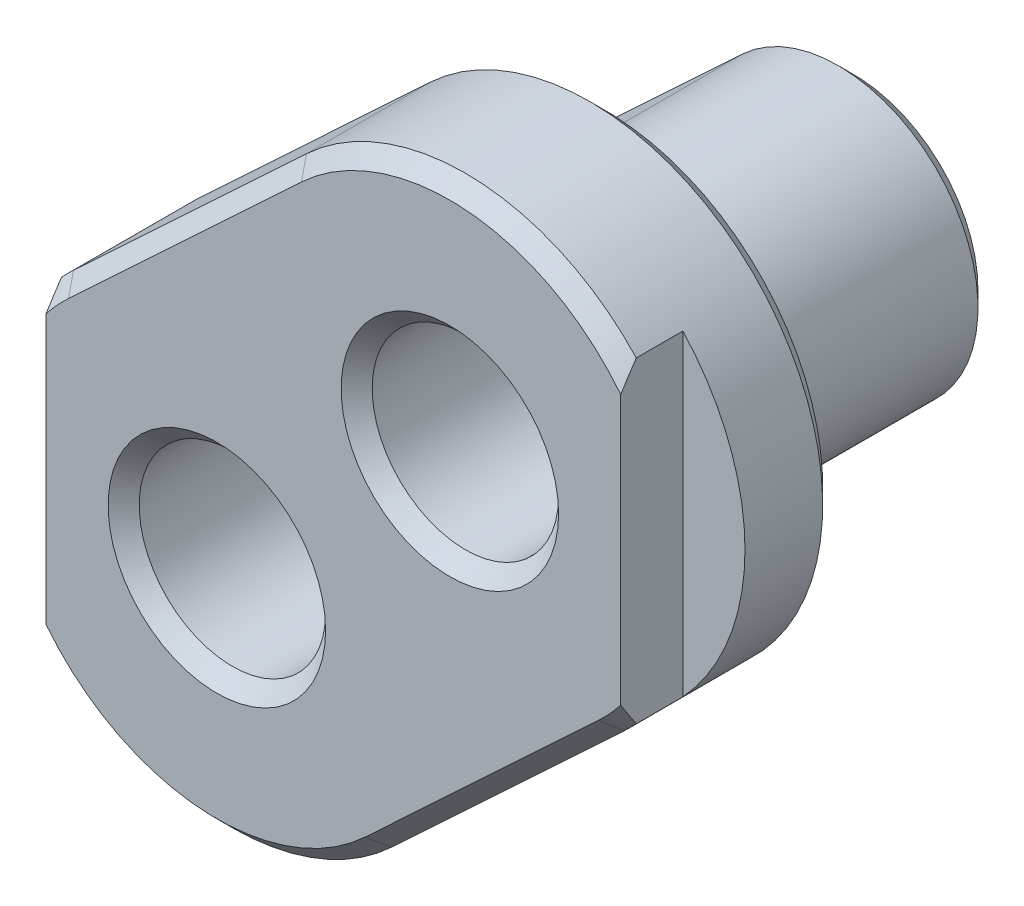
ISO-10303-21;
HEADER;
FILE_DESCRIPTION(('STEP AP214'),'2;1');
FILE_NAME('part.step','',(''),(''),'','','');
FILE_SCHEMA(('AUTOMOTIVE_DESIGN { 1 0 10303 214 1 1 1 1 }'));
ENDSEC;
DATA;
#1=APPLICATION_CONTEXT('core data for automotive mechanical design processes');
#2=APPLICATION_PROTOCOL_DEFINITION('international standard','automotive_design',2000,#1);
#3=PRODUCT_CONTEXT('',#1,'mechanical');
#4=PRODUCT('Part','Part','',(#3));
#5=PRODUCT_RELATED_PRODUCT_CATEGORY('part','',(#4));
#6=PRODUCT_DEFINITION_FORMATION('','',#4);
#7=PRODUCT_DEFINITION_CONTEXT('part definition',#1,'design');
#8=PRODUCT_DEFINITION('design','',#6,#7);
#9=PRODUCT_DEFINITION_SHAPE('','',#8);
#10=(LENGTH_UNIT() NAMED_UNIT(*) SI_UNIT(.MILLI.,.METRE.));
#11=(NAMED_UNIT(*) PLANE_ANGLE_UNIT() SI_UNIT($,.RADIAN.));
#12=(NAMED_UNIT(*) SI_UNIT($,.STERADIAN.) SOLID_ANGLE_UNIT());
#13=UNCERTAINTY_MEASURE_WITH_UNIT(LENGTH_MEASURE(1.E-05),#10,'distance_accuracy_value','');
#14=(GEOMETRIC_REPRESENTATION_CONTEXT(3) GLOBAL_UNCERTAINTY_ASSIGNED_CONTEXT((#13)) GLOBAL_UNIT_ASSIGNED_CONTEXT((#10,
#11,#12)) REPRESENTATION_CONTEXT('',''));
#15=CARTESIAN_POINT('',(0.,0.,0.));
#16=DIRECTION('',(0.,0.,1.));
#17=DIRECTION('',(1.,0.,0.));
#18=AXIS2_PLACEMENT_3D('',#15,#16,#17);
#19=CARTESIAN_POINT('',(0.,0.,16.));
#20=DIRECTION('',(0.,0.,-1.));
#21=DIRECTION('',(-1.,0.,0.));
#22=AXIS2_PLACEMENT_3D('',#19,#20,#21);
#23=CYLINDRICAL_SURFACE('',#22,9.00000000000002);
#24=DIRECTION('',(0.,0.,-1.));
#25=VECTOR('',#24,1.);
#26=CARTESIAN_POINT('',(-6.1408642532401,6.57949741418584,16.));
#27=LINE('',#26,#25);
#28=CARTESIAN_POINT('',(-6.1408642532401,6.57949741418584,16.));
#29=VERTEX_POINT('',#28);
#30=CARTESIAN_POINT('',(-6.1408642532401,6.57949741418584,1.));
#31=VERTEX_POINT('',#30);
#32=EDGE_CURVE('E238',#29,#31,#27,.T.);
#33=ORIENTED_EDGE('',*,*,#32,.T.);
#34=CARTESIAN_POINT('',(0.,0.,1.));
#35=DIRECTION('',(0.,0.,1.));
#36=DIRECTION('',(1.,0.,0.));
#37=AXIS2_PLACEMENT_3D('',#34,#35,#36);
#38=CIRCLE('',#37,9.00000000000002);
#39=CARTESIAN_POINT('',(6.14086425324012,-6.57949741418583,1.));
#40=VERTEX_POINT('',#39);
#41=EDGE_CURVE('E272',#31,#40,#38,.T.);
#42=ORIENTED_EDGE('',*,*,#41,.T.);
#43=DIRECTION('',(0.,0.,-1.));
#44=VECTOR('',#43,1.);
#45=CARTESIAN_POINT('',(6.14086425324012,-6.57949741418583,16.));
#46=LINE('',#45,#44);
#47=CARTESIAN_POINT('',(6.14086425324012,-6.57949741418583,16.));
#48=VERTEX_POINT('',#47);
#49=EDGE_CURVE('E247',#48,#40,#46,.T.);
#50=ORIENTED_EDGE('',*,*,#49,.F.);
#51=CARTESIAN_POINT('',(0.,0.,16.));
#52=DIRECTION('',(0.,0.,1.));
#53=DIRECTION('',(1.,0.,0.));
#54=AXIS2_PLACEMENT_3D('',#51,#52,#53);
#55=CIRCLE('',#54,9.00000000000002);
#56=EDGE_CURVE('E226',#29,#48,#55,.T.);
#57=ORIENTED_EDGE('',*,*,#56,.F.);
#58=EDGE_LOOP('',(#33,#42,#50,#57));
#59=FACE_BOUND('',#58,.T.);
#60=ADVANCED_FACE('F34',(#59),#23,.T.);
#61=CARTESIAN_POINT('',(6.14086425324012,-6.57949741418583,16.));
#62=DIRECTION('',(-0.682318250360011,0.731055268242869,0.));
#63=DIRECTION('',(-0.731055268242869,-0.682318250360011,0.));
#64=AXIS2_PLACEMENT_3D('',#61,#62,#63);
#65=PLANE('',#64);
#66=ORIENTED_EDGE('',*,*,#49,.T.);
#67=DIRECTION('',(0.731055268242869,0.682318250360011,0.));
#68=VECTOR('',#67,1.);
#69=CARTESIAN_POINT('',(6.14086425324012,-6.57949741418583,1.));
#70=LINE('',#69,#68);
#71=CARTESIAN_POINT('',(21.1408642532401,7.42050258581419,1.));
#72=VERTEX_POINT('',#71);
#73=EDGE_CURVE('E250',#40,#72,#70,.T.);
#74=ORIENTED_EDGE('',*,*,#73,.T.);
#75=DIRECTION('',(0.,0.,-1.));
#76=VECTOR('',#75,1.);
#77=CARTESIAN_POINT('',(21.1408642532401,7.42050258581419,16.));
#78=LINE('',#77,#76);
#79=CARTESIAN_POINT('',(21.1408642532401,7.42050258581419,16.));
#80=VERTEX_POINT('',#79);
#81=EDGE_CURVE('E244',#80,#72,#78,.T.);
#82=ORIENTED_EDGE('',*,*,#81,.F.);
#83=DIRECTION('',(0.731055268242869,0.682318250360011,0.));
#84=VECTOR('',#83,1.);
#85=CARTESIAN_POINT('',(6.14086425324012,-6.57949741418583,16.));
#86=LINE('',#85,#84);
#87=EDGE_CURVE('E229',#48,#80,#86,.T.);
#88=ORIENTED_EDGE('',*,*,#87,.F.);
#89=EDGE_LOOP('',(#66,#74,#82,#88));
#90=FACE_BOUND('',#89,.T.);
#91=ADVANCED_FACE('F398',(#90),#65,.F.);
#92=CARTESIAN_POINT('',(15.,14.,16.));
#93=DIRECTION('',(0.,0.,-1.));
#94=DIRECTION('',(-1.,0.,0.));
#95=AXIS2_PLACEMENT_3D('',#92,#93,#94);
#96=CYLINDRICAL_SURFACE('',#95,9.);
#97=ORIENTED_EDGE('',*,*,#81,.T.);
#98=CARTESIAN_POINT('',(15.,14.,1.));
#99=DIRECTION('',(0.,0.,1.));
#100=DIRECTION('',(1.,0.,0.));
#101=AXIS2_PLACEMENT_3D('',#98,#99,#100);
#102=CIRCLE('',#101,9.);
#103=CARTESIAN_POINT('',(8.85913574675993,20.5794974141858,0.999999999999999));
#104=VERTEX_POINT('',#103);
#105=EDGE_CURVE('E268',#72,#104,#102,.T.);
#106=ORIENTED_EDGE('',*,*,#105,.T.);
#107=DIRECTION('',(0.,0.,-1.));
#108=VECTOR('',#107,1.);
#109=CARTESIAN_POINT('',(8.85913574675993,20.5794974141858,16.));
#110=LINE('',#109,#108);
#111=CARTESIAN_POINT('',(8.85913574675993,20.5794974141858,16.));
#112=VERTEX_POINT('',#111);
#113=EDGE_CURVE('E241',#112,#104,#110,.T.);
#114=ORIENTED_EDGE('',*,*,#113,.F.);
#115=CARTESIAN_POINT('',(15.,14.,16.));
#116=DIRECTION('',(0.,0.,1.));
#117=DIRECTION('',(1.,0.,0.));
#118=AXIS2_PLACEMENT_3D('',#115,#116,#117);
#119=CIRCLE('',#118,9.);
#120=EDGE_CURVE('E232',#80,#112,#119,.T.);
#121=ORIENTED_EDGE('',*,*,#120,.F.);
#122=EDGE_LOOP('',(#97,#106,#114,#121));
#123=FACE_BOUND('',#122,.T.);
#124=ADVANCED_FACE('F404',(#123),#96,.T.);
#125=CARTESIAN_POINT('',(8.85913574675992,20.5794974141858,16.));
#126=DIRECTION('',(0.68231825036001,-0.73105526824287,0.));
#127=DIRECTION('',(0.73105526824287,0.68231825036001,0.));
#128=AXIS2_PLACEMENT_3D('',#125,#126,#127);
#129=PLANE('',#128);
#130=ORIENTED_EDGE('',*,*,#113,.T.);
#131=DIRECTION('',(-0.73105526824287,-0.68231825036001,0.));
#132=VECTOR('',#131,1.);
#133=CARTESIAN_POINT('',(8.85913574675992,20.5794974141858,0.999999999999999));
#134=LINE('',#133,#132);
#135=EDGE_CURVE('E270',#104,#31,#134,.T.);
#136=ORIENTED_EDGE('',*,*,#135,.T.);
#137=ORIENTED_EDGE('',*,*,#32,.F.);
#138=DIRECTION('',(-0.73105526824287,-0.68231825036001,0.));
#139=VECTOR('',#138,1.);
#140=CARTESIAN_POINT('',(8.85913574675992,20.5794974141858,16.));
#141=LINE('',#140,#139);
#142=EDGE_CURVE('E235',#112,#29,#141,.T.);
#143=ORIENTED_EDGE('',*,*,#142,.F.);
#144=EDGE_LOOP('',(#130,#136,#137,#143));
#145=FACE_BOUND('',#144,.T.);
#146=ADVANCED_FACE('F545',(#145),#129,.F.);
#147=CARTESIAN_POINT('',(0.,0.,0.));
#148=DIRECTION('',(0.,0.,1.));
#149=DIRECTION('',(1.,0.,0.));
#150=AXIS2_PLACEMENT_3D('',#147,#148,#149);
#151=PLANE('',#150);
#152=CARTESIAN_POINT('',(15.,14.,0.));
#153=DIRECTION('',(0.,0.,1.));
#154=DIRECTION('',(1.,0.,0.));
#155=AXIS2_PLACEMENT_3D('',#152,#153,#154);
#156=CIRCLE('',#155,7.99999999999999);
#157=CARTESIAN_POINT('',(9.54145399711995,19.848442145943,0.));
#158=VERTEX_POINT('',#157);
#159=CARTESIAN_POINT('',(20.4585460028801,8.15155785405706,0.));
#160=VERTEX_POINT('',#159);
#161=EDGE_CURVE('E263',#158,#160,#156,.F.);
#162=ORIENTED_EDGE('',*,*,#161,.T.);
#163=DIRECTION('',(-0.731055268242869,-0.682318250360011,0.));
#164=VECTOR('',#163,1.);
#165=CARTESIAN_POINT('',(5.4585460028801,-5.84844214594296,0.));
#166=LINE('',#165,#164);
#167=CARTESIAN_POINT('',(5.4585460028801,-5.84844214594295,0.));
#168=VERTEX_POINT('',#167);
#169=EDGE_CURVE('E265',#160,#168,#166,.T.);
#170=ORIENTED_EDGE('',*,*,#169,.T.);
#171=CARTESIAN_POINT('',(0.,0.,0.));
#172=DIRECTION('',(0.,0.,1.));
#173=DIRECTION('',(1.,0.,0.));
#174=AXIS2_PLACEMENT_3D('',#171,#172,#173);
#175=CIRCLE('',#174,8.00000000000001);
#176=CARTESIAN_POINT('',(-5.45854600288009,5.84844214594296,0.));
#177=VERTEX_POINT('',#176);
#178=EDGE_CURVE('E259',#168,#177,#175,.F.);
#179=ORIENTED_EDGE('',*,*,#178,.T.);
#180=DIRECTION('',(0.73105526824287,0.68231825036001,0.));
#181=VECTOR('',#180,1.);
#182=CARTESIAN_POINT('',(-5.45854600288009,5.84844214594297,0.));
#183=LINE('',#182,#181);
#184=EDGE_CURVE('E261',#177,#158,#183,.T.);
#185=ORIENTED_EDGE('',*,*,#184,.T.);
#186=EDGE_LOOP('',(#162,#170,#179,#185));
#187=FACE_BOUND('',#186,.T.);
#188=CARTESIAN_POINT('',(15.,14.,0.));
#189=DIRECTION('',(0.,0.,1.));
#190=DIRECTION('',(1.,0.,0.));
#191=AXIS2_PLACEMENT_3D('',#188,#189,#190);
#192=CIRCLE('',#191,7.00000000000003);
#193=CARTESIAN_POINT('',(22.,14.,0.));
#194=VERTEX_POINT('',#193);
#195=EDGE_CURVE('E256',#194,#194,#192,.T.);
#196=ORIENTED_EDGE('',*,*,#195,.T.);
#197=EDGE_LOOP('',(#196));
#198=FACE_BOUND('',#197,.T.);
#199=CARTESIAN_POINT('',(0.,0.,0.));
#200=DIRECTION('',(0.,0.,1.));
#201=DIRECTION('',(1.,0.,0.));
#202=AXIS2_PLACEMENT_3D('',#199,#200,#201);
#203=CIRCLE('',#202,7.00000000000001);
#204=CARTESIAN_POINT('',(7.00000000000001,0.,0.));
#205=VERTEX_POINT('',#204);
#206=EDGE_CURVE('E253',#205,#205,#203,.T.);
#207=ORIENTED_EDGE('',*,*,#206,.T.);
#208=EDGE_LOOP('',(#207));
#209=FACE_BOUND('',#208,.T.);
#210=ADVANCED_FACE('F535',(#187,#198,#209),#151,.F.);
#211=CARTESIAN_POINT('',(0.,0.,16.));
#212=DIRECTION('',(0.,0.,1.));
#213=DIRECTION('',(1.,0.,0.));
#214=AXIS2_PLACEMENT_3D('',#211,#212,#213);
#215=PLANE('',#214);
#216=CARTESIAN_POINT('',(0.,0.,16.));
#217=DIRECTION('',(0.,0.,1.));
#218=DIRECTION('',(1.,0.,0.));
#219=AXIS2_PLACEMENT_3D('',#216,#217,#218);
#220=CIRCLE('',#219,14.);
#221=CARTESIAN_POINT('',(9.55245550504017,-10.2347737554002,16.));
#222=VERTEX_POINT('',#221);
#223=CARTESIAN_POINT('',(-9.55245550504015,10.2347737554002,16.));
#224=VERTEX_POINT('',#223);
#225=EDGE_CURVE('E295',#222,#224,#220,.F.);
#226=ORIENTED_EDGE('',*,*,#225,.T.);
#227=DIRECTION('',(0.73105526824287,0.68231825036001,0.));
#228=VECTOR('',#227,1.);
#229=CARTESIAN_POINT('',(-9.55245550504015,10.2347737554002,16.));
#230=LINE('',#229,#228);
#231=CARTESIAN_POINT('',(5.44754449495988,24.2347737554002,16.));
#232=VERTEX_POINT('',#231);
#233=EDGE_CURVE('E297',#224,#232,#230,.T.);
#234=ORIENTED_EDGE('',*,*,#233,.T.);
#235=CARTESIAN_POINT('',(15.,14.,16.));
#236=DIRECTION('',(0.,0.,1.));
#237=DIRECTION('',(1.,0.,0.));
#238=AXIS2_PLACEMENT_3D('',#235,#236,#237);
#239=CIRCLE('',#238,14.);
#240=CARTESIAN_POINT('',(24.5524555050402,3.76522624459985,16.));
#241=VERTEX_POINT('',#240);
#242=EDGE_CURVE('E293',#232,#241,#239,.F.);
#243=ORIENTED_EDGE('',*,*,#242,.T.);
#244=DIRECTION('',(-0.731055268242869,-0.682318250360011,0.));
#245=VECTOR('',#244,1.);
#246=CARTESIAN_POINT('',(9.55245550504017,-10.2347737554002,16.));
#247=LINE('',#246,#245);
#248=EDGE_CURVE('E291',#241,#222,#247,.T.);
#249=ORIENTED_EDGE('',*,*,#248,.T.);
#250=EDGE_LOOP('',(#226,#234,#243,#249));
#251=FACE_BOUND('',#250,.T.);
#252=ORIENTED_EDGE('',*,*,#142,.T.);
#253=ORIENTED_EDGE('',*,*,#56,.T.);
#254=ORIENTED_EDGE('',*,*,#87,.T.);
#255=ORIENTED_EDGE('',*,*,#120,.T.);
#256=EDGE_LOOP('',(#252,#253,#254,#255));
#257=FACE_BOUND('',#256,.T.);
#258=ADVANCED_FACE('F542',(#251,#257),#215,.F.);
#259=CARTESIAN_POINT('',(0.,0.,26.));
#260=DIRECTION('',(0.,0.,-1.));
#261=DIRECTION('',(-1.,0.,0.));
#262=AXIS2_PLACEMENT_3D('',#259,#260,#261);
#263=CYLINDRICAL_SURFACE('',#262,15.);
#264=DIRECTION('',(0.,0.,-1.));
#265=VECTOR('',#264,1.);
#266=CARTESIAN_POINT('',(-10.2347737554002,10.9658290236431,26.));
#267=LINE('',#266,#265);
#268=CARTESIAN_POINT('',(-10.2347737554002,10.9658290236431,25.));
#269=VERTEX_POINT('',#268);
#270=CARTESIAN_POINT('',(-10.2347737554002,10.9658290236431,17.));
#271=VERTEX_POINT('',#270);
#272=EDGE_CURVE('E197',#269,#271,#267,.T.);
#273=ORIENTED_EDGE('',*,*,#272,.T.);
#274=CARTESIAN_POINT('',(0.,0.,17.));
#275=DIRECTION('',(0.,0.,1.));
#276=DIRECTION('',(1.,0.,0.));
#277=AXIS2_PLACEMENT_3D('',#274,#275,#276);
#278=CIRCLE('',#277,15.);
#279=CARTESIAN_POINT('',(10.2347737554002,-10.965829023643,17.));
#280=VERTEX_POINT('',#279);
#281=EDGE_CURVE('E304',#271,#280,#278,.T.);
#282=ORIENTED_EDGE('',*,*,#281,.T.);
#283=DIRECTION('',(0.,0.,-1.));
#284=VECTOR('',#283,1.);
#285=CARTESIAN_POINT('',(10.2347737554002,-10.965829023643,26.));
#286=LINE('',#285,#284);
#287=CARTESIAN_POINT('',(10.2347737554002,-10.965829023643,25.));
#288=VERTEX_POINT('',#287);
#289=EDGE_CURVE('E223',#288,#280,#286,.T.);
#290=ORIENTED_EDGE('',*,*,#289,.F.);
#291=CARTESIAN_POINT('',(0.,0.,25.));
#292=DIRECTION('',(0.,0.,1.));
#293=DIRECTION('',(1.,0.,0.));
#294=AXIS2_PLACEMENT_3D('',#291,#292,#293);
#295=CIRCLE('',#294,15.);
#296=CARTESIAN_POINT('',(-11.,-10.1980390271856,25.));
#297=VERTEX_POINT('',#296);
#298=EDGE_CURVE('E302',#288,#297,#295,.F.);
#299=ORIENTED_EDGE('',*,*,#298,.T.);
#300=DIRECTION('',(0.,0.,1.));
#301=VECTOR('',#300,1.);
#302=CARTESIAN_POINT('',(-11.,-10.1980390271856,22.));
#303=LINE('',#302,#301);
#304=CARTESIAN_POINT('',(-11.,-10.1980390271856,22.));
#305=VERTEX_POINT('',#304);
#306=EDGE_CURVE('E207',#305,#297,#303,.T.);
#307=ORIENTED_EDGE('',*,*,#306,.F.);
#308=CARTESIAN_POINT('',(0.,0.,22.));
#309=DIRECTION('',(0.,0.,1.));
#310=DIRECTION('',(1.,0.,0.));
#311=AXIS2_PLACEMENT_3D('',#308,#309,#310);
#312=CIRCLE('',#311,15.);
#313=CARTESIAN_POINT('',(-11.,10.1980390271856,22.));
#314=VERTEX_POINT('',#313);
#315=EDGE_CURVE('E201',#314,#305,#312,.T.);
#316=ORIENTED_EDGE('',*,*,#315,.F.);
#317=DIRECTION('',(0.,0.,1.));
#318=VECTOR('',#317,1.);
#319=CARTESIAN_POINT('',(-11.,10.1980390271856,22.));
#320=LINE('',#319,#318);
#321=CARTESIAN_POINT('',(-11.,10.1980390271856,25.));
#322=VERTEX_POINT('',#321);
#323=EDGE_CURVE('E211',#314,#322,#320,.T.);
#324=ORIENTED_EDGE('',*,*,#323,.T.);
#325=CARTESIAN_POINT('',(0.,0.,25.));
#326=DIRECTION('',(0.,0.,1.));
#327=DIRECTION('',(1.,0.,0.));
#328=AXIS2_PLACEMENT_3D('',#325,#326,#327);
#329=CIRCLE('',#328,15.);
#330=EDGE_CURVE('E300',#322,#269,#329,.F.);
#331=ORIENTED_EDGE('',*,*,#330,.T.);
#332=EDGE_LOOP('',(#273,#282,#290,#299,#307,#316,#324,#331));
#333=FACE_BOUND('',#332,.T.);
#334=ADVANCED_FACE('F501',(#333),#263,.T.);
#335=CARTESIAN_POINT('',(10.2347737554002,-10.965829023643,26.));
#336=DIRECTION('',(-0.682318250360011,0.731055268242869,0.));
#337=DIRECTION('',(-0.731055268242869,-0.682318250360011,0.));
#338=AXIS2_PLACEMENT_3D('',#335,#336,#337);
#339=PLANE('',#338);
#340=ORIENTED_EDGE('',*,*,#289,.T.);
#341=DIRECTION('',(0.731055268242869,0.682318250360011,0.));
#342=VECTOR('',#341,1.);
#343=CARTESIAN_POINT('',(10.2347737554002,-10.965829023643,17.));
#344=LINE('',#343,#342);
#345=CARTESIAN_POINT('',(25.2347737554002,3.03417097635697,17.));
#346=VERTEX_POINT('',#345);
#347=EDGE_CURVE('E313',#280,#346,#344,.T.);
#348=ORIENTED_EDGE('',*,*,#347,.T.);
#349=DIRECTION('',(0.,0.,-1.));
#350=VECTOR('',#349,1.);
#351=CARTESIAN_POINT('',(25.2347737554002,3.03417097635697,26.));
#352=LINE('',#351,#350);
#353=CARTESIAN_POINT('',(25.2347737554002,3.03417097635697,25.));
#354=VERTEX_POINT('',#353);
#355=EDGE_CURVE('E221',#354,#346,#352,.T.);
#356=ORIENTED_EDGE('',*,*,#355,.F.);
#357=DIRECTION('',(-0.731055268242869,-0.682318250360011,0.));
#358=VECTOR('',#357,1.);
#359=CARTESIAN_POINT('',(10.2347737554002,-10.965829023643,25.));
#360=LINE('',#359,#358);
#361=EDGE_CURVE('E311',#354,#288,#360,.T.);
#362=ORIENTED_EDGE('',*,*,#361,.T.);
#363=EDGE_LOOP('',(#340,#348,#356,#362));
#364=FACE_BOUND('',#363,.T.);
#365=ADVANCED_FACE('F498',(#364),#339,.F.);
#366=CARTESIAN_POINT('',(15.,14.,26.));
#367=DIRECTION('',(0.,0.,-1.));
#368=DIRECTION('',(-1.,0.,0.));
#369=AXIS2_PLACEMENT_3D('',#366,#367,#368);
#370=CYLINDRICAL_SURFACE('',#369,15.);
#371=ORIENTED_EDGE('',*,*,#355,.T.);
#372=CARTESIAN_POINT('',(15.,14.,17.));
#373=DIRECTION('',(0.,0.,1.));
#374=DIRECTION('',(1.,0.,0.));
#375=AXIS2_PLACEMENT_3D('',#372,#373,#374);
#376=CIRCLE('',#375,15.);
#377=CARTESIAN_POINT('',(4.76522624459987,24.9658290236431,17.));
#378=VERTEX_POINT('',#377);
#379=EDGE_CURVE('E309',#346,#378,#376,.T.);
#380=ORIENTED_EDGE('',*,*,#379,.T.);
#381=DIRECTION('',(0.,0.,-1.));
#382=VECTOR('',#381,1.);
#383=CARTESIAN_POINT('',(4.76522624459987,24.9658290236431,26.));
#384=LINE('',#383,#382);
#385=CARTESIAN_POINT('',(4.76522624459987,24.9658290236431,25.));
#386=VERTEX_POINT('',#385);
#387=EDGE_CURVE('E218',#386,#378,#384,.T.);
#388=ORIENTED_EDGE('',*,*,#387,.F.);
#389=CARTESIAN_POINT('',(15.,14.,25.));
#390=DIRECTION('',(0.,0.,1.));
#391=DIRECTION('',(1.,0.,0.));
#392=AXIS2_PLACEMENT_3D('',#389,#390,#391);
#393=CIRCLE('',#392,15.);
#394=CARTESIAN_POINT('',(26.,24.1980390271856,25.));
#395=VERTEX_POINT('',#394);
#396=EDGE_CURVE('E195',#386,#395,#393,.F.);
#397=ORIENTED_EDGE('',*,*,#396,.T.);
#398=DIRECTION('',(0.,0.,1.));
#399=VECTOR('',#398,1.);
#400=CARTESIAN_POINT('',(26.,24.1980390271856,22.));
#401=LINE('',#400,#399);
#402=CARTESIAN_POINT('',(26.,24.1980390271856,22.));
#403=VERTEX_POINT('',#402);
#404=EDGE_CURVE('E187',#403,#395,#401,.T.);
#405=ORIENTED_EDGE('',*,*,#404,.F.);
#406=CARTESIAN_POINT('',(15.,14.,22.));
#407=DIRECTION('',(0.,0.,1.));
#408=DIRECTION('',(1.,0.,0.));
#409=AXIS2_PLACEMENT_3D('',#406,#407,#408);
#410=CIRCLE('',#409,15.);
#411=CARTESIAN_POINT('',(26.,3.80196097281442,22.));
#412=VERTEX_POINT('',#411);
#413=EDGE_CURVE('E174',#412,#403,#410,.T.);
#414=ORIENTED_EDGE('',*,*,#413,.F.);
#415=DIRECTION('',(0.,0.,1.));
#416=VECTOR('',#415,1.);
#417=CARTESIAN_POINT('',(26.,3.80196097281442,22.));
#418=LINE('',#417,#416);
#419=CARTESIAN_POINT('',(26.,3.80196097281442,25.));
#420=VERTEX_POINT('',#419);
#421=EDGE_CURVE('E189',#412,#420,#418,.T.);
#422=ORIENTED_EDGE('',*,*,#421,.T.);
#423=CARTESIAN_POINT('',(15.,14.,25.));
#424=DIRECTION('',(0.,0.,1.));
#425=DIRECTION('',(1.,0.,0.));
#426=AXIS2_PLACEMENT_3D('',#423,#424,#425);
#427=CIRCLE('',#426,15.);
#428=EDGE_CURVE('E307',#420,#354,#427,.F.);
#429=ORIENTED_EDGE('',*,*,#428,.T.);
#430=EDGE_LOOP('',(#371,#380,#388,#397,#405,#414,#422,#429));
#431=FACE_BOUND('',#430,.T.);
#432=ADVANCED_FACE('F192',(#431),#370,.T.);
#433=CARTESIAN_POINT('',(4.76522624459987,24.9658290236431,26.));
#434=DIRECTION('',(0.68231825036001,-0.73105526824287,0.));
#435=DIRECTION('',(0.73105526824287,0.68231825036001,0.));
#436=AXIS2_PLACEMENT_3D('',#433,#434,#435);
#437=PLANE('',#436);
#438=ORIENTED_EDGE('',*,*,#387,.T.);
#439=DIRECTION('',(-0.73105526824287,-0.68231825036001,0.));
#440=VECTOR('',#439,1.);
#441=CARTESIAN_POINT('',(4.76522624459987,24.9658290236431,17.));
#442=LINE('',#441,#440);
#443=EDGE_CURVE('E288',#378,#271,#442,.T.);
#444=ORIENTED_EDGE('',*,*,#443,.T.);
#445=ORIENTED_EDGE('',*,*,#272,.F.);
#446=DIRECTION('',(0.73105526824287,0.68231825036001,0.));
#447=VECTOR('',#446,1.);
#448=CARTESIAN_POINT('',(4.76522624459987,24.9658290236431,25.));
#449=LINE('',#448,#447);
#450=EDGE_CURVE('E286',#269,#386,#449,.T.);
#451=ORIENTED_EDGE('',*,*,#450,.T.);
#452=EDGE_LOOP('',(#438,#444,#445,#451));
#453=FACE_BOUND('',#452,.T.);
#454=ADVANCED_FACE('F486',(#453),#437,.F.);
#455=CARTESIAN_POINT('',(0.,0.,26.));
#456=DIRECTION('',(0.,0.,1.));
#457=DIRECTION('',(1.,0.,0.));
#458=AXIS2_PLACEMENT_3D('',#455,#456,#457);
#459=PLANE('',#458);
#460=CARTESIAN_POINT('',(15.,14.,26.));
#461=DIRECTION('',(0.,0.,1.));
#462=DIRECTION('',(1.,0.,0.));
#463=AXIS2_PLACEMENT_3D('',#460,#461,#462);
#464=CIRCLE('',#463,7.00000000000001);
#465=CARTESIAN_POINT('',(22.,14.,26.));
#466=VERTEX_POINT('',#465);
#467=EDGE_CURVE('E329',#466,#466,#464,.F.);
#468=ORIENTED_EDGE('',*,*,#467,.T.);
#469=EDGE_LOOP('',(#468));
#470=FACE_BOUND('',#469,.T.);
#471=CARTESIAN_POINT('',(0.,0.,26.));
#472=DIRECTION('',(0.,0.,1.));
#473=DIRECTION('',(1.,0.,0.));
#474=AXIS2_PLACEMENT_3D('',#471,#472,#473);
#475=CIRCLE('',#474,7.00000000000001);
#476=CARTESIAN_POINT('',(7.00000000000001,0.,26.));
#477=VERTEX_POINT('',#476);
#478=EDGE_CURVE('E326',#477,#477,#475,.F.);
#479=ORIENTED_EDGE('',*,*,#478,.T.);
#480=EDGE_LOOP('',(#479));
#481=FACE_BOUND('',#480,.T.);
#482=DIRECTION('',(0.731055268242869,0.682318250360011,0.));
#483=VECTOR('',#482,1.);
#484=CARTESIAN_POINT('',(24.5524555050402,3.76522624459984,26.));
#485=LINE('',#484,#483);
#486=CARTESIAN_POINT('',(9.55245550504018,-10.2347737554002,26.));
#487=VERTEX_POINT('',#486);
#488=CARTESIAN_POINT('',(24.5524555050402,3.76522624459984,26.));
#489=VERTEX_POINT('',#488);
#490=EDGE_CURVE('E52',#487,#489,#485,.T.);
#491=ORIENTED_EDGE('',*,*,#490,.T.);
#492=CARTESIAN_POINT('',(15.,14.,26.));
#493=DIRECTION('',(0.,0.,1.));
#494=DIRECTION('',(1.,0.,0.));
#495=AXIS2_PLACEMENT_3D('',#492,#493,#494);
#496=CIRCLE('',#495,14.);
#497=CARTESIAN_POINT('',(26.,5.3397459621556,26.));
#498=VERTEX_POINT('',#497);
#499=EDGE_CURVE('E324',#489,#498,#496,.T.);
#500=ORIENTED_EDGE('',*,*,#499,.T.);
#501=DIRECTION('',(0.,-1.,0.));
#502=VECTOR('',#501,1.);
#503=CARTESIAN_POINT('',(26.,24.1980390271856,26.));
#504=LINE('',#503,#502);
#505=CARTESIAN_POINT('',(26.,22.6602540378444,26.));
#506=VERTEX_POINT('',#505);
#507=EDGE_CURVE('E181',#506,#498,#504,.T.);
#508=ORIENTED_EDGE('',*,*,#507,.F.);
#509=CARTESIAN_POINT('',(15.,14.,26.));
#510=DIRECTION('',(0.,0.,1.));
#511=DIRECTION('',(1.,0.,0.));
#512=AXIS2_PLACEMENT_3D('',#509,#510,#511);
#513=CIRCLE('',#512,14.);
#514=CARTESIAN_POINT('',(5.44754449495988,24.2347737554002,26.));
#515=VERTEX_POINT('',#514);
#516=EDGE_CURVE('E315',#506,#515,#513,.T.);
#517=ORIENTED_EDGE('',*,*,#516,.T.);
#518=DIRECTION('',(-0.73105526824287,-0.68231825036001,0.));
#519=VECTOR('',#518,1.);
#520=CARTESIAN_POINT('',(-9.55245550504016,10.2347737554002,26.));
#521=LINE('',#520,#519);
#522=CARTESIAN_POINT('',(-9.55245550504016,10.2347737554002,26.));
#523=VERTEX_POINT('',#522);
#524=EDGE_CURVE('E317',#515,#523,#521,.T.);
#525=ORIENTED_EDGE('',*,*,#524,.T.);
#526=CARTESIAN_POINT('',(0.,0.,26.));
#527=DIRECTION('',(0.,0.,1.));
#528=DIRECTION('',(1.,0.,0.));
#529=AXIS2_PLACEMENT_3D('',#526,#527,#528);
#530=CIRCLE('',#529,14.);
#531=CARTESIAN_POINT('',(-11.,8.66025403784442,26.));
#532=VERTEX_POINT('',#531);
#533=EDGE_CURVE('E319',#523,#532,#530,.T.);
#534=ORIENTED_EDGE('',*,*,#533,.T.);
#535=DIRECTION('',(0.,1.,0.));
#536=VECTOR('',#535,1.);
#537=CARTESIAN_POINT('',(-11.,10.1980390271856,26.));
#538=LINE('',#537,#536);
#539=CARTESIAN_POINT('',(-11.,-8.66025403784443,26.));
#540=VERTEX_POINT('',#539);
#541=EDGE_CURVE('E204',#540,#532,#538,.T.);
#542=ORIENTED_EDGE('',*,*,#541,.F.);
#543=CARTESIAN_POINT('',(0.,0.,26.));
#544=DIRECTION('',(0.,0.,1.));
#545=DIRECTION('',(1.,0.,0.));
#546=AXIS2_PLACEMENT_3D('',#543,#544,#545);
#547=CIRCLE('',#546,14.);
#548=EDGE_CURVE('E57',#540,#487,#547,.T.);
#549=ORIENTED_EDGE('',*,*,#548,.T.);
#550=EDGE_LOOP('',(#491,#500,#508,#517,#525,#534,#542,#549));
#551=FACE_BOUND('',#550,.T.);
#552=ADVANCED_FACE('F360',(#470,#481,#551),#459,.T.);
#553=CARTESIAN_POINT('',(-11.,10.1980390271856,22.));
#554=DIRECTION('',(1.,0.,0.));
#555=DIRECTION('',(0.,0.,-1.));
#556=AXIS2_PLACEMENT_3D('',#553,#554,#555);
#557=PLANE('',#556);
#558=ORIENTED_EDGE('',*,*,#306,.T.);
#559=CARTESIAN_POINT('',(-11.,-10.1980390271856,25.));
#560=CARTESIAN_POINT('',(-11.,-10.0716097932226,25.0859534985509));
#561=CARTESIAN_POINT('',(-11.,-9.94478168559518,25.1713222713732));
#562=CARTESIAN_POINT('',(-11.,-9.69029386318126,25.3407786548004));
#563=CARTESIAN_POINT('',(-11.,-9.56263424634973,25.4248664125517));
#564=CARTESIAN_POINT('',(-11.,-9.30641873923809,25.591670016424));
#565=CARTESIAN_POINT('',(-11.,-9.17786283805281,25.6743858458112));
#566=CARTESIAN_POINT('',(-11.,-8.91978924484249,25.8383361007494));
#567=CARTESIAN_POINT('',(-11.,-8.79027144318527,25.9195703536757));
#568=CARTESIAN_POINT('',(-11.,-8.66025403784443,26.));
#569=B_SPLINE_CURVE_WITH_KNOTS('',3,(#559,#560,#561,#562,#563,#564,#565,#566,#567,#568),
.UNSPECIFIED.,.F.,.F.,(4,2,2,2,4),(0.,0.458640555019232,0.917228023923433,1.37582108227049,
1.83446723618274),.UNSPECIFIED.);
#570=EDGE_CURVE('E11',#297,#540,#569,.T.);
#571=ORIENTED_EDGE('',*,*,#570,.T.);
#572=ORIENTED_EDGE('',*,*,#541,.T.);
#573=CARTESIAN_POINT('',(-11.,8.66025403784442,26.));
#574=CARTESIAN_POINT('',(-11.,8.79027144318525,25.9195703536757));
#575=CARTESIAN_POINT('',(-11.,8.91978924484247,25.8383361007494));
#576=CARTESIAN_POINT('',(-11.,9.17786283805281,25.6743858458112));
#577=CARTESIAN_POINT('',(-11.,9.30641873923808,25.591670016424));
#578=CARTESIAN_POINT('',(-11.,9.56263424634972,25.4248664125517));
#579=CARTESIAN_POINT('',(-11.,9.69029386318126,25.3407786548004));
#580=CARTESIAN_POINT('',(-11.,9.94478168559518,25.1713222713732));
#581=CARTESIAN_POINT('',(-11.,10.0716097932226,25.0859534985509));
#582=CARTESIAN_POINT('',(-11.,10.1980390271856,25.));
#583=B_SPLINE_CURVE_WITH_KNOTS('',3,(#573,#574,#575,#576,#577,#578,#579,#580,#581,#582),
.UNSPECIFIED.,.F.,.F.,(4,2,2,2,4),(0.,0.458646153912249,0.917239212259314,1.37582668116352,
1.83446723618275),.UNSPECIFIED.);
#584=EDGE_CURVE('E44',#532,#322,#583,.T.);
#585=ORIENTED_EDGE('',*,*,#584,.T.);
#586=ORIENTED_EDGE('',*,*,#323,.F.);
#587=DIRECTION('',(0.,1.,0.));
#588=VECTOR('',#587,1.);
#589=CARTESIAN_POINT('',(-11.,10.1980390271856,22.));
#590=LINE('',#589,#588);
#591=EDGE_CURVE('E203',#305,#314,#590,.T.);
#592=ORIENTED_EDGE('',*,*,#591,.F.);
#593=EDGE_LOOP('',(#558,#571,#572,#585,#586,#592));
#594=FACE_BOUND('',#593,.T.);
#595=ADVANCED_FACE('F355',(#594),#557,.F.);
#596=CARTESIAN_POINT('',(0.,0.,22.));
#597=DIRECTION('',(0.,0.,1.));
#598=DIRECTION('',(1.,0.,0.));
#599=AXIS2_PLACEMENT_3D('',#596,#597,#598);
#600=PLANE('',#599);
#601=ORIENTED_EDGE('',*,*,#315,.T.);
#602=ORIENTED_EDGE('',*,*,#591,.T.);
#603=EDGE_LOOP('',(#601,#602));
#604=FACE_BOUND('',#603,.T.);
#605=ADVANCED_FACE('F350',(#604),#600,.T.);
#606=CARTESIAN_POINT('',(26.,24.1980390271856,22.));
#607=DIRECTION('',(-1.,0.,0.));
#608=DIRECTION('',(0.,0.,1.));
#609=AXIS2_PLACEMENT_3D('',#606,#607,#608);
#610=PLANE('',#609);
#611=ORIENTED_EDGE('',*,*,#507,.T.);
#612=CARTESIAN_POINT('',(26.,5.3397459621556,26.));
#613=CARTESIAN_POINT('',(26.,5.20972855681477,25.9195703536757));
#614=CARTESIAN_POINT('',(26.,5.08021075515755,25.8383361007494));
#615=CARTESIAN_POINT('',(26.,4.82213716194722,25.6743858458112));
#616=CARTESIAN_POINT('',(26.,4.69358126076195,25.591670016424));
#617=CARTESIAN_POINT('',(26.,4.4373657536503,25.4248664125517));
#618=CARTESIAN_POINT('',(26.,4.30970613681877,25.3407786548004));
#619=CARTESIAN_POINT('',(26.,4.05521831440485,25.1713222713732));
#620=CARTESIAN_POINT('',(26.,3.92839020677738,25.0859534985509));
#621=CARTESIAN_POINT('',(26.,3.80196097281443,25.));
#622=B_SPLINE_CURVE_WITH_KNOTS('',3,(#612,#613,#614,#615,#616,#617,#618,#619,#620,#621),
.UNSPECIFIED.,.F.,.F.,(4,2,2,2,4),(0.,0.458646153912245,0.917239212259307,1.37582668116351,
1.83446723618274),.UNSPECIFIED.);
#623=EDGE_CURVE('E339',#498,#420,#622,.T.);
#624=ORIENTED_EDGE('',*,*,#623,.T.);
#625=ORIENTED_EDGE('',*,*,#421,.F.);
#626=DIRECTION('',(0.,-1.,0.));
#627=VECTOR('',#626,1.);
#628=CARTESIAN_POINT('',(26.,24.1980390271856,22.));
#629=LINE('',#628,#627);
#630=EDGE_CURVE('E177',#403,#412,#629,.T.);
#631=ORIENTED_EDGE('',*,*,#630,.F.);
#632=ORIENTED_EDGE('',*,*,#404,.T.);
#633=CARTESIAN_POINT('',(26.,24.1980390271856,25.));
#634=CARTESIAN_POINT('',(26.,24.0716097932226,25.0859534985509));
#635=CARTESIAN_POINT('',(26.,23.9447816855952,25.1713222713732));
#636=CARTESIAN_POINT('',(26.,23.6902938631812,25.3407786548004));
#637=CARTESIAN_POINT('',(26.,23.5626342463497,25.4248664125517));
#638=CARTESIAN_POINT('',(26.,23.3064187392381,25.591670016424));
#639=CARTESIAN_POINT('',(26.,23.1778628380528,25.6743858458112));
#640=CARTESIAN_POINT('',(26.,22.9197892448424,25.8383361007494));
#641=CARTESIAN_POINT('',(26.,22.7902714431852,25.9195703536757));
#642=CARTESIAN_POINT('',(26.,22.6602540378444,26.));
#643=B_SPLINE_CURVE_WITH_KNOTS('',3,(#633,#634,#635,#636,#637,#638,#639,#640,#641,#642),
.UNSPECIFIED.,.F.,.F.,(4,2,2,2,4),(0.,0.45864055501923,0.917228023923444,1.37582108227051,
1.83446723618276),.UNSPECIFIED.);
#644=EDGE_CURVE('E332',#395,#506,#643,.T.);
#645=ORIENTED_EDGE('',*,*,#644,.T.);
#646=EDGE_LOOP('',(#611,#624,#625,#631,#632,#645));
#647=FACE_BOUND('',#646,.T.);
#648=ADVANCED_FACE('F186',(#647),#610,.F.);
#649=CARTESIAN_POINT('',(15.,14.,22.));
#650=DIRECTION('',(0.,0.,1.));
#651=DIRECTION('',(1.,0.,0.));
#652=AXIS2_PLACEMENT_3D('',#649,#650,#651);
#653=PLANE('',#652);
#654=ORIENTED_EDGE('',*,*,#413,.T.);
#655=ORIENTED_EDGE('',*,*,#630,.T.);
#656=EDGE_LOOP('',(#654,#655));
#657=FACE_BOUND('',#656,.T.);
#658=ADVANCED_FACE('F176',(#657),#653,.T.);
#659=CARTESIAN_POINT('',(15.,14.,26.));
#660=DIRECTION('',(0.,0.,-1.));
#661=DIRECTION('',(-1.,0.,0.));
#662=AXIS2_PLACEMENT_3D('',#659,#660,#661);
#663=CYLINDRICAL_SURFACE('',#662,6.);
#664=CARTESIAN_POINT('',(15.,14.,1.00000000000002));
#665=DIRECTION('',(0.,0.,1.));
#666=DIRECTION('',(1.,0.,0.));
#667=AXIS2_PLACEMENT_3D('',#664,#665,#666);
#668=CIRCLE('',#667,6.);
#669=CARTESIAN_POINT('',(21.,14.,1.00000000000002));
#670=VERTEX_POINT('',#669);
#671=EDGE_CURVE('E277',#670,#670,#668,.F.);
#672=ORIENTED_EDGE('',*,*,#671,.T.);
#673=EDGE_LOOP('',(#672));
#674=FACE_BOUND('',#673,.T.);
#675=CARTESIAN_POINT('',(15.,14.,25.));
#676=DIRECTION('',(0.,0.,1.));
#677=DIRECTION('',(1.,0.,0.));
#678=AXIS2_PLACEMENT_3D('',#675,#676,#677);
#679=CIRCLE('',#678,6.);
#680=CARTESIAN_POINT('',(21.,14.,25.));
#681=VERTEX_POINT('',#680);
#682=EDGE_CURVE('E274',#681,#681,#679,.T.);
#683=ORIENTED_EDGE('',*,*,#682,.T.);
#684=EDGE_LOOP('',(#683));
#685=FACE_BOUND('',#684,.T.);
#686=ADVANCED_FACE('F609',(#674,#685),#663,.F.);
#687=CARTESIAN_POINT('',(0.,0.,26.));
#688=DIRECTION('',(0.,0.,-1.));
#689=DIRECTION('',(-1.,0.,0.));
#690=AXIS2_PLACEMENT_3D('',#687,#688,#689);
#691=CYLINDRICAL_SURFACE('',#690,6.);
#692=CARTESIAN_POINT('',(0.,0.,1.));
#693=DIRECTION('',(0.,0.,1.));
#694=DIRECTION('',(1.,0.,0.));
#695=AXIS2_PLACEMENT_3D('',#692,#693,#694);
#696=CIRCLE('',#695,6.);
#697=CARTESIAN_POINT('',(6.,0.,1.));
#698=VERTEX_POINT('',#697);
#699=EDGE_CURVE('E283',#698,#698,#696,.F.);
#700=ORIENTED_EDGE('',*,*,#699,.T.);
#701=EDGE_LOOP('',(#700));
#702=FACE_BOUND('',#701,.T.);
#703=CARTESIAN_POINT('',(0.,0.,25.));
#704=DIRECTION('',(0.,0.,1.));
#705=DIRECTION('',(1.,0.,0.));
#706=AXIS2_PLACEMENT_3D('',#703,#704,#705);
#707=CIRCLE('',#706,6.);
#708=CARTESIAN_POINT('',(6.,0.,25.));
#709=VERTEX_POINT('',#708);
#710=EDGE_CURVE('E280',#709,#709,#707,.T.);
#711=ORIENTED_EDGE('',*,*,#710,.T.);
#712=EDGE_LOOP('',(#711));
#713=FACE_BOUND('',#712,.T.);
#714=ADVANCED_FACE('F425',(#702,#713),#691,.F.);
#715=CARTESIAN_POINT('',(8.85913574675992,20.5794974141858,1.));
#716=DIRECTION('',(0.482471861756901,-0.516934137596682,0.707106781186551));
#717=DIRECTION('',(-0.73105526824287,-0.68231825036001,0.));
#718=AXIS2_PLACEMENT_3D('',#715,#716,#717);
#719=PLANE('',#718);
#720=DIRECTION('',(-0.482471861756906,0.516934137596687,0.707106781186544));
#721=VECTOR('',#720,1.);
#722=CARTESIAN_POINT('',(9.54145399711995,19.848442145943,0.));
#723=LINE('',#722,#721);
#724=EDGE_CURVE('E523',#158,#104,#723,.T.);
#725=ORIENTED_EDGE('',*,*,#724,.F.);
#726=ORIENTED_EDGE('',*,*,#184,.F.);
#727=DIRECTION('',(0.482471861756906,-0.516934137596687,-0.707106781186544));
#728=VECTOR('',#727,1.);
#729=CARTESIAN_POINT('',(-6.1408642532401,6.57949741418584,0.999999999999999));
#730=LINE('',#729,#728);
#731=EDGE_CURVE('E210',#31,#177,#730,.T.);
#732=ORIENTED_EDGE('',*,*,#731,.F.);
#733=ORIENTED_EDGE('',*,*,#135,.F.);
#734=EDGE_LOOP('',(#725,#726,#732,#733));
#735=FACE_BOUND('',#734,.T.);
#736=ADVANCED_FACE('F421',(#735),#719,.F.);
#737=CARTESIAN_POINT('',(0.,0.,1.));
#738=DIRECTION('',(0.,0.,1.));
#739=DIRECTION('',(1.,0.,0.));
#740=AXIS2_PLACEMENT_3D('',#737,#738,#739);
#741=CONICAL_SURFACE('',#740,9.00000000000002,0.785398163397453);
#742=ORIENTED_EDGE('',*,*,#731,.T.);
#743=ORIENTED_EDGE('',*,*,#178,.F.);
#744=DIRECTION('',(-0.482471861756906,0.516934137596685,-0.707106781186545));
#745=VECTOR('',#744,1.);
#746=CARTESIAN_POINT('',(6.14086425324012,-6.57949741418583,1.));
#747=LINE('',#746,#745);
#748=EDGE_CURVE('E518',#40,#168,#747,.T.);
#749=ORIENTED_EDGE('',*,*,#748,.F.);
#750=ORIENTED_EDGE('',*,*,#41,.F.);
#751=EDGE_LOOP('',(#742,#743,#749,#750));
#752=FACE_BOUND('',#751,.T.);
#753=ADVANCED_FACE('F417',(#752),#741,.T.);
#754=CARTESIAN_POINT('',(15.,14.,1.));
#755=DIRECTION('',(0.,0.,1.));
#756=DIRECTION('',(1.,0.,0.));
#757=AXIS2_PLACEMENT_3D('',#754,#755,#756);
#758=CONICAL_SURFACE('',#757,9.,0.785398163397453);
#759=ORIENTED_EDGE('',*,*,#724,.T.);
#760=ORIENTED_EDGE('',*,*,#105,.F.);
#761=DIRECTION('',(0.482471861756907,-0.516934137596686,0.707106781186544));
#762=VECTOR('',#761,1.);
#763=CARTESIAN_POINT('',(20.4585460028801,8.15155785405706,0.));
#764=LINE('',#763,#762);
#765=EDGE_CURVE('E375',#160,#72,#764,.T.);
#766=ORIENTED_EDGE('',*,*,#765,.F.);
#767=ORIENTED_EDGE('',*,*,#161,.F.);
#768=EDGE_LOOP('',(#759,#760,#766,#767));
#769=FACE_BOUND('',#768,.T.);
#770=ADVANCED_FACE('F413',(#769),#758,.T.);
#771=CARTESIAN_POINT('',(6.14086425324012,-6.57949741418583,1.));
#772=DIRECTION('',(-0.482471861756902,0.516934137596681,0.707106781186551));
#773=DIRECTION('',(0.731055268242869,0.682318250360011,0.));
#774=AXIS2_PLACEMENT_3D('',#771,#772,#773);
#775=PLANE('',#774);
#776=ORIENTED_EDGE('',*,*,#748,.T.);
#777=ORIENTED_EDGE('',*,*,#169,.F.);
#778=ORIENTED_EDGE('',*,*,#765,.T.);
#779=ORIENTED_EDGE('',*,*,#73,.F.);
#780=EDGE_LOOP('',(#776,#777,#778,#779));
#781=FACE_BOUND('',#780,.T.);
#782=ADVANCED_FACE('F409',(#781),#775,.F.);
#783=CARTESIAN_POINT('',(15.,14.,1.00000000000002));
#784=DIRECTION('',(0.,0.,-1.));
#785=DIRECTION('',(-1.,0.,0.));
#786=AXIS2_PLACEMENT_3D('',#783,#784,#785);
#787=CONICAL_SURFACE('',#786,6.,0.785398163397452);
#788=ORIENTED_EDGE('',*,*,#195,.F.);
#789=EDGE_LOOP('',(#788));
#790=FACE_BOUND('',#789,.T.);
#791=ORIENTED_EDGE('',*,*,#671,.F.);
#792=EDGE_LOOP('',(#791));
#793=FACE_BOUND('',#792,.T.);
#794=ADVANCED_FACE('F412',(#790,#793),#787,.F.);
#795=CARTESIAN_POINT('',(0.,0.,1.));
#796=DIRECTION('',(0.,0.,-1.));
#797=DIRECTION('',(-1.,0.,0.));
#798=AXIS2_PLACEMENT_3D('',#795,#796,#797);
#799=CONICAL_SURFACE('',#798,6.,0.785398163397451);
#800=ORIENTED_EDGE('',*,*,#206,.F.);
#801=EDGE_LOOP('',(#800));
#802=FACE_BOUND('',#801,.T.);
#803=ORIENTED_EDGE('',*,*,#699,.F.);
#804=EDGE_LOOP('',(#803));
#805=FACE_BOUND('',#804,.T.);
#806=ADVANCED_FACE('F429',(#802,#805),#799,.F.);
#807=CARTESIAN_POINT('',(10.2347737554002,-10.965829023643,17.));
#808=DIRECTION('',(-0.482471861756903,0.516934137596681,0.70710678118655));
#809=DIRECTION('',(0.731055268242869,0.682318250360011,0.));
#810=AXIS2_PLACEMENT_3D('',#807,#808,#809);
#811=PLANE('',#810);
#812=DIRECTION('',(0.482471861756906,-0.516934137596685,0.707106781186545));
#813=VECTOR('',#812,1.);
#814=CARTESIAN_POINT('',(9.55245550504017,-10.2347737554002,16.));
#815=LINE('',#814,#813);
#816=EDGE_CURVE('E507',#222,#280,#815,.T.);
#817=ORIENTED_EDGE('',*,*,#816,.F.);
#818=ORIENTED_EDGE('',*,*,#248,.F.);
#819=DIRECTION('',(-0.482471861756907,0.516934137596685,-0.707106781186544));
#820=VECTOR('',#819,1.);
#821=CARTESIAN_POINT('',(25.2347737554002,3.03417097635697,17.));
#822=LINE('',#821,#820);
#823=EDGE_CURVE('E475',#346,#241,#822,.T.);
#824=ORIENTED_EDGE('',*,*,#823,.F.);
#825=ORIENTED_EDGE('',*,*,#347,.F.);
#826=EDGE_LOOP('',(#817,#818,#824,#825));
#827=FACE_BOUND('',#826,.T.);
#828=ADVANCED_FACE('F433',(#827),#811,.F.);
#829=CARTESIAN_POINT('',(15.,14.,17.));
#830=DIRECTION('',(0.,0.,1.));
#831=DIRECTION('',(1.,0.,0.));
#832=AXIS2_PLACEMENT_3D('',#829,#830,#831);
#833=CONICAL_SURFACE('',#832,15.,0.785398163397453);
#834=ORIENTED_EDGE('',*,*,#823,.T.);
#835=ORIENTED_EDGE('',*,*,#242,.F.);
#836=DIRECTION('',(0.482471861756905,-0.516934137596686,-0.707106781186545));
#837=VECTOR('',#836,1.);
#838=CARTESIAN_POINT('',(4.76522624459987,24.9658290236431,17.));
#839=LINE('',#838,#837);
#840=EDGE_CURVE('E510',#378,#232,#839,.T.);
#841=ORIENTED_EDGE('',*,*,#840,.F.);
#842=ORIENTED_EDGE('',*,*,#379,.F.);
#843=EDGE_LOOP('',(#834,#835,#841,#842));
#844=FACE_BOUND('',#843,.T.);
#845=ADVANCED_FACE('F443',(#844),#833,.T.);
#846=CARTESIAN_POINT('',(0.,0.,17.));
#847=DIRECTION('',(0.,0.,1.));
#848=DIRECTION('',(1.,0.,0.));
#849=AXIS2_PLACEMENT_3D('',#846,#847,#848);
#850=CONICAL_SURFACE('',#849,15.,0.785398163397453);
#851=ORIENTED_EDGE('',*,*,#816,.T.);
#852=ORIENTED_EDGE('',*,*,#281,.F.);
#853=DIRECTION('',(-0.482471861756906,0.516934137596686,0.707106781186544));
#854=VECTOR('',#853,1.);
#855=CARTESIAN_POINT('',(-9.55245550504015,10.2347737554002,16.));
#856=LINE('',#855,#854);
#857=EDGE_CURVE('E471',#224,#271,#856,.T.);
#858=ORIENTED_EDGE('',*,*,#857,.F.);
#859=ORIENTED_EDGE('',*,*,#225,.F.);
#860=EDGE_LOOP('',(#851,#852,#858,#859));
#861=FACE_BOUND('',#860,.T.);
#862=ADVANCED_FACE('F439',(#861),#850,.T.);
#863=CARTESIAN_POINT('',(4.76522624459987,24.9658290236431,17.));
#864=DIRECTION('',(0.482471861756901,-0.516934137596682,0.707106781186551));
#865=DIRECTION('',(-0.73105526824287,-0.68231825036001,0.));
#866=AXIS2_PLACEMENT_3D('',#863,#864,#865);
#867=PLANE('',#866);
#868=ORIENTED_EDGE('',*,*,#840,.T.);
#869=ORIENTED_EDGE('',*,*,#233,.F.);
#870=ORIENTED_EDGE('',*,*,#857,.T.);
#871=ORIENTED_EDGE('',*,*,#443,.F.);
#872=EDGE_LOOP('',(#868,#869,#870,#871));
#873=FACE_BOUND('',#872,.T.);
#874=ADVANCED_FACE('F435',(#873),#867,.F.);
#875=CARTESIAN_POINT('',(15.,14.,26.));
#876=DIRECTION('',(0.,0.,1.));
#877=DIRECTION('',(1.,0.,0.));
#878=AXIS2_PLACEMENT_3D('',#875,#876,#877);
#879=CONICAL_SURFACE('',#878,7.00000000000001,0.785398163397445);
#880=ORIENTED_EDGE('',*,*,#682,.F.);
#881=EDGE_LOOP('',(#880));
#882=FACE_BOUND('',#881,.T.);
#883=ORIENTED_EDGE('',*,*,#467,.F.);
#884=EDGE_LOOP('',(#883));
#885=FACE_BOUND('',#884,.T.);
#886=ADVANCED_FACE('F438',(#882,#885),#879,.F.);
#887=CARTESIAN_POINT('',(0.,0.,26.));
#888=DIRECTION('',(0.,0.,1.));
#889=DIRECTION('',(1.,0.,0.));
#890=AXIS2_PLACEMENT_3D('',#887,#888,#889);
#891=CONICAL_SURFACE('',#890,7.00000000000001,0.785398163397445);
#892=ORIENTED_EDGE('',*,*,#710,.F.);
#893=EDGE_LOOP('',(#892));
#894=FACE_BOUND('',#893,.T.);
#895=ORIENTED_EDGE('',*,*,#478,.F.);
#896=EDGE_LOOP('',(#895));
#897=FACE_BOUND('',#896,.T.);
#898=ADVANCED_FACE('F382',(#894,#897),#891,.F.);
#899=CARTESIAN_POINT('',(0.,0.,26.));
#900=DIRECTION('',(0.,0.,-1.));
#901=DIRECTION('',(-1.,0.,0.));
#902=AXIS2_PLACEMENT_3D('',#899,#900,#901);
#903=CONICAL_SURFACE('',#902,14.,0.785398163397443);
#904=ORIENTED_EDGE('',*,*,#570,.F.);
#905=ORIENTED_EDGE('',*,*,#298,.F.);
#906=DIRECTION('',(0.482471861756902,-0.51693413759668,-0.707106781186551));
#907=VECTOR('',#906,1.);
#908=CARTESIAN_POINT('',(9.55245550504018,-10.2347737554002,26.));
#909=LINE('',#908,#907);
#910=EDGE_CURVE('E468',#487,#288,#909,.T.);
#911=ORIENTED_EDGE('',*,*,#910,.F.);
#912=ORIENTED_EDGE('',*,*,#548,.F.);
#913=EDGE_LOOP('',(#904,#905,#911,#912));
#914=FACE_BOUND('',#913,.T.);
#915=ADVANCED_FACE('F377',(#914),#903,.T.);
#916=CARTESIAN_POINT('',(9.55245550504018,-10.2347737554002,26.));
#917=DIRECTION('',(0.482471861756907,-0.516934137596685,0.707106781186544));
#918=DIRECTION('',(-0.731055268242869,-0.682318250360011,0.));
#919=AXIS2_PLACEMENT_3D('',#916,#917,#918);
#920=PLANE('',#919);
#921=ORIENTED_EDGE('',*,*,#910,.T.);
#922=ORIENTED_EDGE('',*,*,#361,.F.);
#923=DIRECTION('',(0.482471861756903,-0.51693413759668,-0.707106781186551));
#924=VECTOR('',#923,1.);
#925=CARTESIAN_POINT('',(24.5524555050402,3.76522624459984,26.));
#926=LINE('',#925,#924);
#927=EDGE_CURVE('E466',#489,#354,#926,.T.);
#928=ORIENTED_EDGE('',*,*,#927,.F.);
#929=ORIENTED_EDGE('',*,*,#490,.F.);
#930=EDGE_LOOP('',(#921,#922,#928,#929));
#931=FACE_BOUND('',#930,.T.);
#932=ADVANCED_FACE('F381',(#931),#920,.T.);
#933=CARTESIAN_POINT('',(15.,14.,26.));
#934=DIRECTION('',(0.,0.,-1.));
#935=DIRECTION('',(-1.,0.,0.));
#936=AXIS2_PLACEMENT_3D('',#933,#934,#935);
#937=CONICAL_SURFACE('',#936,14.,0.785398163397443);
#938=ORIENTED_EDGE('',*,*,#927,.T.);
#939=ORIENTED_EDGE('',*,*,#428,.F.);
#940=ORIENTED_EDGE('',*,*,#623,.F.);
#941=ORIENTED_EDGE('',*,*,#499,.F.);
#942=EDGE_LOOP('',(#938,#939,#940,#941));
#943=FACE_BOUND('',#942,.T.);
#944=ADVANCED_FACE('F394',(#943),#937,.T.);
#945=CARTESIAN_POINT('',(15.,14.,26.));
#946=DIRECTION('',(0.,0.,-1.));
#947=DIRECTION('',(-1.,0.,0.));
#948=AXIS2_PLACEMENT_3D('',#945,#946,#947);
#949=CONICAL_SURFACE('',#948,14.,0.785398163397445);
#950=ORIENTED_EDGE('',*,*,#644,.F.);
#951=ORIENTED_EDGE('',*,*,#396,.F.);
#952=DIRECTION('',(-0.482471861756902,0.516934137596682,-0.70710678118655));
#953=VECTOR('',#952,1.);
#954=CARTESIAN_POINT('',(5.44754449495988,24.2347737554002,26.));
#955=LINE('',#954,#953);
#956=EDGE_CURVE('E39',#515,#386,#955,.T.);
#957=ORIENTED_EDGE('',*,*,#956,.F.);
#958=ORIENTED_EDGE('',*,*,#516,.F.);
#959=EDGE_LOOP('',(#950,#951,#957,#958));
#960=FACE_BOUND('',#959,.T.);
#961=ADVANCED_FACE('F36',(#960),#949,.T.);
#962=CARTESIAN_POINT('',(-9.55245550504015,10.2347737554002,26.));
#963=DIRECTION('',(-0.482471861756905,0.516934137596686,0.707106781186545));
#964=DIRECTION('',(0.73105526824287,0.68231825036001,0.));
#965=AXIS2_PLACEMENT_3D('',#962,#963,#964);
#966=PLANE('',#965);
#967=ORIENTED_EDGE('',*,*,#956,.T.);
#968=ORIENTED_EDGE('',*,*,#450,.F.);
#969=DIRECTION('',(-0.482471861756901,0.516934137596682,-0.707106781186551));
#970=VECTOR('',#969,1.);
#971=CARTESIAN_POINT('',(-9.55245550504016,10.2347737554002,26.));
#972=LINE('',#971,#970);
#973=EDGE_CURVE('E473',#523,#269,#972,.T.);
#974=ORIENTED_EDGE('',*,*,#973,.F.);
#975=ORIENTED_EDGE('',*,*,#524,.F.);
#976=EDGE_LOOP('',(#967,#968,#974,#975));
#977=FACE_BOUND('',#976,.T.);
#978=ADVANCED_FACE('F387',(#977),#966,.T.);
#979=CARTESIAN_POINT('',(0.,0.,26.));
#980=DIRECTION('',(0.,0.,-1.));
#981=DIRECTION('',(-1.,0.,0.));
#982=AXIS2_PLACEMENT_3D('',#979,#980,#981);
#983=CONICAL_SURFACE('',#982,14.,0.785398163397444);
#984=ORIENTED_EDGE('',*,*,#973,.T.);
#985=ORIENTED_EDGE('',*,*,#330,.F.);
#986=ORIENTED_EDGE('',*,*,#584,.F.);
#987=ORIENTED_EDGE('',*,*,#533,.F.);
#988=EDGE_LOOP('',(#984,#985,#986,#987));
#989=FACE_BOUND('',#988,.T.);
#990=ADVANCED_FACE('F384',(#989),#983,.T.);
#991=CLOSED_SHELL('',(#60,#91,#124,#146,#210,#258,#334,#365,#432,#454,#552,#595,#605,#648,#658,
#686,#714,#736,#753,#770,#782,#794,#806,#828,#845,#862,#874,#886,#898,#915,#932,#944,#961,#978,#990));
#992=MANIFOLD_SOLID_BREP('B2',#991);
#993=ADVANCED_BREP_SHAPE_REPRESENTATION('',(#18,#992),#14);
#994=SHAPE_DEFINITION_REPRESENTATION(#9,#993);
ENDSEC;
END-ISO-10303-21;
